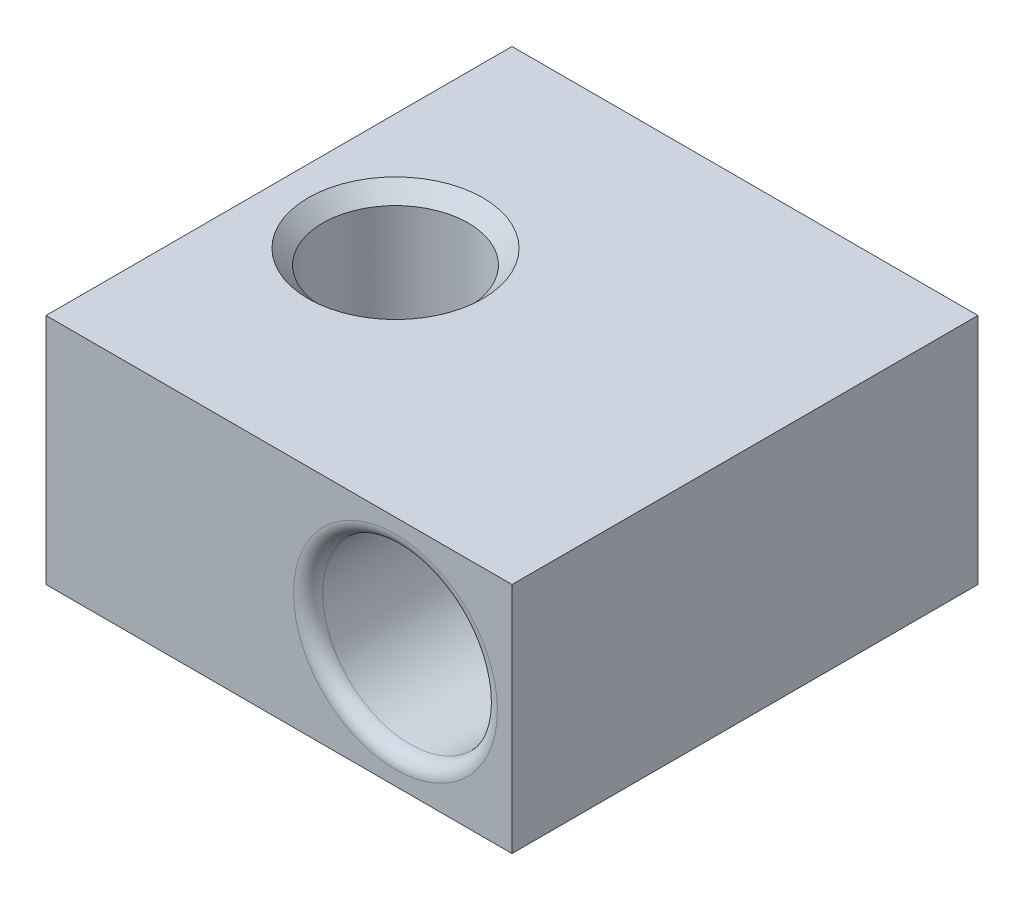
ISO-10303-21;
HEADER;
FILE_DESCRIPTION(('STEP AP214'),'2;1');
FILE_NAME('part.step','',(''),(''),'','','');
FILE_SCHEMA(('AUTOMOTIVE_DESIGN { 1 0 10303 214 1 1 1 1 }'));
ENDSEC;
DATA;
#1=APPLICATION_CONTEXT('core data for automotive mechanical design processes');
#2=APPLICATION_PROTOCOL_DEFINITION('international standard','automotive_design',2000,#1);
#3=PRODUCT_CONTEXT('',#1,'mechanical');
#4=PRODUCT('Part','Part','',(#3));
#5=PRODUCT_RELATED_PRODUCT_CATEGORY('part','',(#4));
#6=PRODUCT_DEFINITION_FORMATION('','',#4);
#7=PRODUCT_DEFINITION_CONTEXT('part definition',#1,'design');
#8=PRODUCT_DEFINITION('design','',#6,#7);
#9=PRODUCT_DEFINITION_SHAPE('','',#8);
#10=(LENGTH_UNIT() NAMED_UNIT(*) SI_UNIT(.MILLI.,.METRE.));
#11=(NAMED_UNIT(*) PLANE_ANGLE_UNIT() SI_UNIT($,.RADIAN.));
#12=(NAMED_UNIT(*) SI_UNIT($,.STERADIAN.) SOLID_ANGLE_UNIT());
#13=UNCERTAINTY_MEASURE_WITH_UNIT(LENGTH_MEASURE(1.E-05),#10,'distance_accuracy_value','');
#14=(GEOMETRIC_REPRESENTATION_CONTEXT(3) GLOBAL_UNCERTAINTY_ASSIGNED_CONTEXT((#13)) GLOBAL_UNIT_ASSIGNED_CONTEXT((#10,
#11,#12)) REPRESENTATION_CONTEXT('',''));
#15=CARTESIAN_POINT('',(0.,0.,0.));
#16=DIRECTION('',(0.,0.,1.));
#17=DIRECTION('',(1.,0.,0.));
#18=AXIS2_PLACEMENT_3D('',#15,#16,#17);
#19=CARTESIAN_POINT('',(0.,0.,16.));
#20=DIRECTION('',(0.,0.,-1.));
#21=DIRECTION('',(-1.,0.,0.));
#22=AXIS2_PLACEMENT_3D('',#19,#20,#21);
#23=PLANE('',#22);
#24=CARTESIAN_POINT('',(12.,4.,16.));
#25=DIRECTION('',(0.,0.,-1.));
#26=DIRECTION('',(-1.,0.,0.));
#27=AXIS2_PLACEMENT_3D('',#24,#25,#26);
#28=CIRCLE('',#27,3.5);
#29=CARTESIAN_POINT('',(8.5,4.,16.));
#30=VERTEX_POINT('',#29);
#31=EDGE_CURVE('E11',#30,#30,#28,.T.);
#32=ORIENTED_EDGE('',*,*,#31,.T.);
#33=EDGE_LOOP('',(#32));
#34=FACE_BOUND('',#33,.T.);
#35=DIRECTION('',(0.,-1.,0.));
#36=VECTOR('',#35,1.);
#37=CARTESIAN_POINT('',(0.,0.,16.));
#38=LINE('',#37,#36);
#39=CARTESIAN_POINT('',(0.,8.,16.));
#40=VERTEX_POINT('',#39);
#41=CARTESIAN_POINT('',(0.,0.,16.));
#42=VERTEX_POINT('',#41);
#43=EDGE_CURVE('E86',#40,#42,#38,.T.);
#44=ORIENTED_EDGE('',*,*,#43,.T.);
#45=DIRECTION('',(1.,0.,0.));
#46=VECTOR('',#45,1.);
#47=CARTESIAN_POINT('',(0.,0.,16.));
#48=LINE('',#47,#46);
#49=CARTESIAN_POINT('',(16.,0.,16.));
#50=VERTEX_POINT('',#49);
#51=EDGE_CURVE('E82',#42,#50,#48,.T.);
#52=ORIENTED_EDGE('',*,*,#51,.T.);
#53=DIRECTION('',(0.,1.,0.));
#54=VECTOR('',#53,1.);
#55=CARTESIAN_POINT('',(16.,0.,16.));
#56=LINE('',#55,#54);
#57=CARTESIAN_POINT('',(16.,8.,16.));
#58=VERTEX_POINT('',#57);
#59=EDGE_CURVE('E84',#50,#58,#56,.T.);
#60=ORIENTED_EDGE('',*,*,#59,.T.);
#61=DIRECTION('',(-1.,0.,0.));
#62=VECTOR('',#61,1.);
#63=CARTESIAN_POINT('',(0.,8.,16.));
#64=LINE('',#63,#62);
#65=EDGE_CURVE('E51',#58,#40,#64,.T.);
#66=ORIENTED_EDGE('',*,*,#65,.T.);
#67=EDGE_LOOP('',(#44,#52,#60,#66));
#68=FACE_BOUND('',#67,.T.);
#69=ADVANCED_FACE('F34',(#34,#68),#23,.F.);
#70=CARTESIAN_POINT('',(0.,0.,0.));
#71=DIRECTION('',(0.,0.,-1.));
#72=DIRECTION('',(-1.,0.,0.));
#73=AXIS2_PLACEMENT_3D('',#70,#71,#72);
#74=PLANE('',#73);
#75=CARTESIAN_POINT('',(12.,4.,0.));
#76=DIRECTION('',(0.,0.,-1.));
#77=DIRECTION('',(-1.,0.,0.));
#78=AXIS2_PLACEMENT_3D('',#75,#76,#77);
#79=CIRCLE('',#78,3.5);
#80=CARTESIAN_POINT('',(8.5,4.,0.));
#81=VERTEX_POINT('',#80);
#82=EDGE_CURVE('E122',#81,#81,#79,.F.);
#83=ORIENTED_EDGE('',*,*,#82,.T.);
#84=EDGE_LOOP('',(#83));
#85=FACE_BOUND('',#84,.T.);
#86=DIRECTION('',(0.,-1.,0.));
#87=VECTOR('',#86,1.);
#88=CARTESIAN_POINT('',(0.,0.,0.));
#89=LINE('',#88,#87);
#90=CARTESIAN_POINT('',(0.,8.,0.));
#91=VERTEX_POINT('',#90);
#92=CARTESIAN_POINT('',(0.,0.,0.));
#93=VERTEX_POINT('',#92);
#94=EDGE_CURVE('E101',#91,#93,#89,.T.);
#95=ORIENTED_EDGE('',*,*,#94,.F.);
#96=DIRECTION('',(-1.,0.,0.));
#97=VECTOR('',#96,1.);
#98=CARTESIAN_POINT('',(0.,8.,0.));
#99=LINE('',#98,#97);
#100=CARTESIAN_POINT('',(16.,8.,0.));
#101=VERTEX_POINT('',#100);
#102=EDGE_CURVE('E74',#101,#91,#99,.T.);
#103=ORIENTED_EDGE('',*,*,#102,.F.);
#104=DIRECTION('',(0.,1.,0.));
#105=VECTOR('',#104,1.);
#106=CARTESIAN_POINT('',(16.,0.,0.));
#107=LINE('',#106,#105);
#108=CARTESIAN_POINT('',(16.,0.,0.));
#109=VERTEX_POINT('',#108);
#110=EDGE_CURVE('E68',#109,#101,#107,.T.);
#111=ORIENTED_EDGE('',*,*,#110,.F.);
#112=DIRECTION('',(1.,0.,0.));
#113=VECTOR('',#112,1.);
#114=CARTESIAN_POINT('',(0.,0.,0.));
#115=LINE('',#114,#113);
#116=EDGE_CURVE('E91',#93,#109,#115,.T.);
#117=ORIENTED_EDGE('',*,*,#116,.F.);
#118=EDGE_LOOP('',(#95,#103,#111,#117));
#119=FACE_BOUND('',#118,.T.);
#120=ADVANCED_FACE('F139',(#85,#119),#74,.T.);
#121=CARTESIAN_POINT('',(0.,0.,16.));
#122=DIRECTION('',(1.,0.,0.));
#123=DIRECTION('',(0.,0.,-1.));
#124=AXIS2_PLACEMENT_3D('',#121,#122,#123);
#125=PLANE('',#124);
#126=ORIENTED_EDGE('',*,*,#94,.T.);
#127=DIRECTION('',(0.,0.,-1.));
#128=VECTOR('',#127,1.);
#129=CARTESIAN_POINT('',(0.,0.,16.));
#130=LINE('',#129,#128);
#131=EDGE_CURVE('E92',#42,#93,#130,.T.);
#132=ORIENTED_EDGE('',*,*,#131,.F.);
#133=ORIENTED_EDGE('',*,*,#43,.F.);
#134=DIRECTION('',(0.,0.,-1.));
#135=VECTOR('',#134,1.);
#136=CARTESIAN_POINT('',(0.,8.,16.));
#137=LINE('',#136,#135);
#138=EDGE_CURVE('E97',#40,#91,#137,.T.);
#139=ORIENTED_EDGE('',*,*,#138,.T.);
#140=EDGE_LOOP('',(#126,#132,#133,#139));
#141=FACE_BOUND('',#140,.T.);
#142=ADVANCED_FACE('F142',(#141),#125,.F.);
#143=CARTESIAN_POINT('',(0.,0.,16.));
#144=DIRECTION('',(0.,1.,0.));
#145=DIRECTION('',(0.,0.,1.));
#146=AXIS2_PLACEMENT_3D('',#143,#144,#145);
#147=PLANE('',#146);
#148=CARTESIAN_POINT('',(4.,0.,8.));
#149=DIRECTION('',(0.,1.,0.));
#150=DIRECTION('',(0.,0.,1.));
#151=AXIS2_PLACEMENT_3D('',#148,#149,#150);
#152=CIRCLE('',#151,3.);
#153=CARTESIAN_POINT('',(4.,0.,11.));
#154=VERTEX_POINT('',#153);
#155=EDGE_CURVE('E110',#154,#154,#152,.T.);
#156=ORIENTED_EDGE('',*,*,#155,.T.);
#157=EDGE_LOOP('',(#156));
#158=FACE_BOUND('',#157,.T.);
#159=ORIENTED_EDGE('',*,*,#116,.T.);
#160=DIRECTION('',(0.,0.,-1.));
#161=VECTOR('',#160,1.);
#162=CARTESIAN_POINT('',(16.,0.,16.));
#163=LINE('',#162,#161);
#164=EDGE_CURVE('E89',#50,#109,#163,.T.);
#165=ORIENTED_EDGE('',*,*,#164,.F.);
#166=ORIENTED_EDGE('',*,*,#51,.F.);
#167=ORIENTED_EDGE('',*,*,#131,.T.);
#168=EDGE_LOOP('',(#159,#165,#166,#167));
#169=FACE_BOUND('',#168,.T.);
#170=ADVANCED_FACE('F90',(#158,#169),#147,.F.);
#171=CARTESIAN_POINT('',(16.,0.,16.));
#172=DIRECTION('',(-1.,0.,0.));
#173=DIRECTION('',(0.,0.,1.));
#174=AXIS2_PLACEMENT_3D('',#171,#172,#173);
#175=PLANE('',#174);
#176=ORIENTED_EDGE('',*,*,#110,.T.);
#177=DIRECTION('',(0.,0.,-1.));
#178=VECTOR('',#177,1.);
#179=CARTESIAN_POINT('',(16.,8.,16.));
#180=LINE('',#179,#178);
#181=EDGE_CURVE('E93',#58,#101,#180,.T.);
#182=ORIENTED_EDGE('',*,*,#181,.F.);
#183=ORIENTED_EDGE('',*,*,#59,.F.);
#184=ORIENTED_EDGE('',*,*,#164,.T.);
#185=EDGE_LOOP('',(#176,#182,#183,#184));
#186=FACE_BOUND('',#185,.T.);
#187=ADVANCED_FACE('F95',(#186),#175,.F.);
#188=CARTESIAN_POINT('',(0.,8.,16.));
#189=DIRECTION('',(0.,-1.,0.));
#190=DIRECTION('',(0.,0.,-1.));
#191=AXIS2_PLACEMENT_3D('',#188,#189,#190);
#192=PLANE('',#191);
#193=CARTESIAN_POINT('',(4.,8.,8.));
#194=DIRECTION('',(0.,-1.,0.));
#195=DIRECTION('',(0.,0.,-1.));
#196=AXIS2_PLACEMENT_3D('',#193,#194,#195);
#197=CIRCLE('',#196,3.);
#198=CARTESIAN_POINT('',(4.,8.,5.));
#199=VERTEX_POINT('',#198);
#200=EDGE_CURVE('E119',#199,#199,#197,.T.);
#201=ORIENTED_EDGE('',*,*,#200,.T.);
#202=EDGE_LOOP('',(#201));
#203=FACE_BOUND('',#202,.T.);
#204=ORIENTED_EDGE('',*,*,#102,.T.);
#205=ORIENTED_EDGE('',*,*,#138,.F.);
#206=ORIENTED_EDGE('',*,*,#65,.F.);
#207=ORIENTED_EDGE('',*,*,#181,.T.);
#208=EDGE_LOOP('',(#204,#205,#206,#207));
#209=FACE_BOUND('',#208,.T.);
#210=ADVANCED_FACE('F146',(#203,#209),#192,.F.);
#211=CARTESIAN_POINT('',(12.,4.,16.));
#212=DIRECTION('',(0.,0.,-1.));
#213=DIRECTION('',(-1.,0.,0.));
#214=AXIS2_PLACEMENT_3D('',#211,#212,#213);
#215=CYLINDRICAL_SURFACE('',#214,3.);
#216=CARTESIAN_POINT('',(12.,4.,0.5));
#217=DIRECTION('',(0.,0.,-1.));
#218=DIRECTION('',(-1.,0.,0.));
#219=AXIS2_PLACEMENT_3D('',#216,#217,#218);
#220=CIRCLE('',#219,3.);
#221=CARTESIAN_POINT('',(9.,4.,0.5));
#222=VERTEX_POINT('',#221);
#223=EDGE_CURVE('E43',#222,#222,#220,.T.);
#224=ORIENTED_EDGE('',*,*,#223,.T.);
#225=EDGE_LOOP('',(#224));
#226=FACE_BOUND('',#225,.T.);
#227=CARTESIAN_POINT('',(12.,4.,15.5));
#228=DIRECTION('',(0.,0.,-1.));
#229=DIRECTION('',(-1.,0.,0.));
#230=AXIS2_PLACEMENT_3D('',#227,#228,#229);
#231=CIRCLE('',#230,3.);
#232=CARTESIAN_POINT('',(9.,4.,15.5));
#233=VERTEX_POINT('',#232);
#234=EDGE_CURVE('E125',#233,#233,#231,.F.);
#235=ORIENTED_EDGE('',*,*,#234,.T.);
#236=EDGE_LOOP('',(#235));
#237=FACE_BOUND('',#236,.T.);
#238=ADVANCED_FACE('F130',(#226,#237),#215,.F.);
#239=CARTESIAN_POINT('',(4.,0.,8.));
#240=DIRECTION('',(0.,1.,0.));
#241=DIRECTION('',(0.,0.,1.));
#242=AXIS2_PLACEMENT_3D('',#239,#240,#241);
#243=CYLINDRICAL_SURFACE('',#242,2.5);
#244=CARTESIAN_POINT('',(4.,0.5,8.));
#245=DIRECTION('',(0.,1.,0.));
#246=DIRECTION('',(0.,0.,1.));
#247=AXIS2_PLACEMENT_3D('',#244,#245,#246);
#248=CIRCLE('',#247,2.5);
#249=CARTESIAN_POINT('',(4.,0.5,10.5));
#250=VERTEX_POINT('',#249);
#251=EDGE_CURVE('E116',#250,#250,#248,.F.);
#252=ORIENTED_EDGE('',*,*,#251,.T.);
#253=EDGE_LOOP('',(#252));
#254=FACE_BOUND('',#253,.T.);
#255=CARTESIAN_POINT('',(4.,7.5,8.));
#256=DIRECTION('',(0.,-1.,0.));
#257=DIRECTION('',(0.,0.,-1.));
#258=AXIS2_PLACEMENT_3D('',#255,#256,#257);
#259=CIRCLE('',#258,2.5);
#260=CARTESIAN_POINT('',(4.,7.5,5.5));
#261=VERTEX_POINT('',#260);
#262=EDGE_CURVE('E113',#261,#261,#259,.F.);
#263=ORIENTED_EDGE('',*,*,#262,.T.);
#264=EDGE_LOOP('',(#263));
#265=FACE_BOUND('',#264,.T.);
#266=ADVANCED_FACE('F154',(#254,#265),#243,.F.);
#267=CARTESIAN_POINT('',(4.,0.,8.));
#268=DIRECTION('',(0.,-1.,0.));
#269=DIRECTION('',(0.,0.,-1.));
#270=AXIS2_PLACEMENT_3D('',#267,#268,#269);
#271=CONICAL_SURFACE('',#270,3.,0.785398163397445);
#272=ORIENTED_EDGE('',*,*,#251,.F.);
#273=EDGE_LOOP('',(#272));
#274=FACE_BOUND('',#273,.T.);
#275=ORIENTED_EDGE('',*,*,#155,.F.);
#276=EDGE_LOOP('',(#275));
#277=FACE_BOUND('',#276,.T.);
#278=ADVANCED_FACE('F164',(#274,#277),#271,.F.);
#279=CARTESIAN_POINT('',(4.,7.5,8.));
#280=DIRECTION('',(0.,1.,0.));
#281=DIRECTION('',(0.,0.,1.));
#282=AXIS2_PLACEMENT_3D('',#279,#280,#281);
#283=CONICAL_SURFACE('',#282,2.5,0.78539816339745);
#284=ORIENTED_EDGE('',*,*,#200,.F.);
#285=EDGE_LOOP('',(#284));
#286=FACE_BOUND('',#285,.T.);
#287=ORIENTED_EDGE('',*,*,#262,.F.);
#288=EDGE_LOOP('',(#287));
#289=FACE_BOUND('',#288,.T.);
#290=ADVANCED_FACE('F136',(#286,#289),#283,.F.);
#291=CARTESIAN_POINT('',(12.,4.,0.5));
#292=DIRECTION('',(0.,0.,-1.));
#293=DIRECTION('',(-1.,0.,0.));
#294=AXIS2_PLACEMENT_3D('',#291,#292,#293);
#295=TOROIDAL_SURFACE('',#294,3.5,0.5);
#296=ORIENTED_EDGE('',*,*,#223,.F.);
#297=EDGE_LOOP('',(#296));
#298=FACE_BOUND('',#297,.T.);
#299=ORIENTED_EDGE('',*,*,#82,.F.);
#300=EDGE_LOOP('',(#299));
#301=FACE_BOUND('',#300,.T.);
#302=ADVANCED_FACE('F133',(#298,#301),#295,.T.);
#303=CARTESIAN_POINT('',(12.,4.,15.5));
#304=DIRECTION('',(0.,0.,-1.));
#305=DIRECTION('',(-1.,0.,0.));
#306=AXIS2_PLACEMENT_3D('',#303,#304,#305);
#307=TOROIDAL_SURFACE('',#306,3.5,0.5);
#308=ORIENTED_EDGE('',*,*,#31,.F.);
#309=EDGE_LOOP('',(#308));
#310=FACE_BOUND('',#309,.T.);
#311=ORIENTED_EDGE('',*,*,#234,.F.);
#312=EDGE_LOOP('',(#311));
#313=FACE_BOUND('',#312,.T.);
#314=ADVANCED_FACE('F36',(#310,#313),#307,.T.);
#315=CLOSED_SHELL('',(#69,#120,#142,#170,#187,#210,#238,#266,#278,#290,#302,#314));
#316=MANIFOLD_SOLID_BREP('B2',#315);
#317=ADVANCED_BREP_SHAPE_REPRESENTATION('',(#18,#316),#14);
#318=SHAPE_DEFINITION_REPRESENTATION(#9,#317);
ENDSEC;
END-ISO-10303-21;
